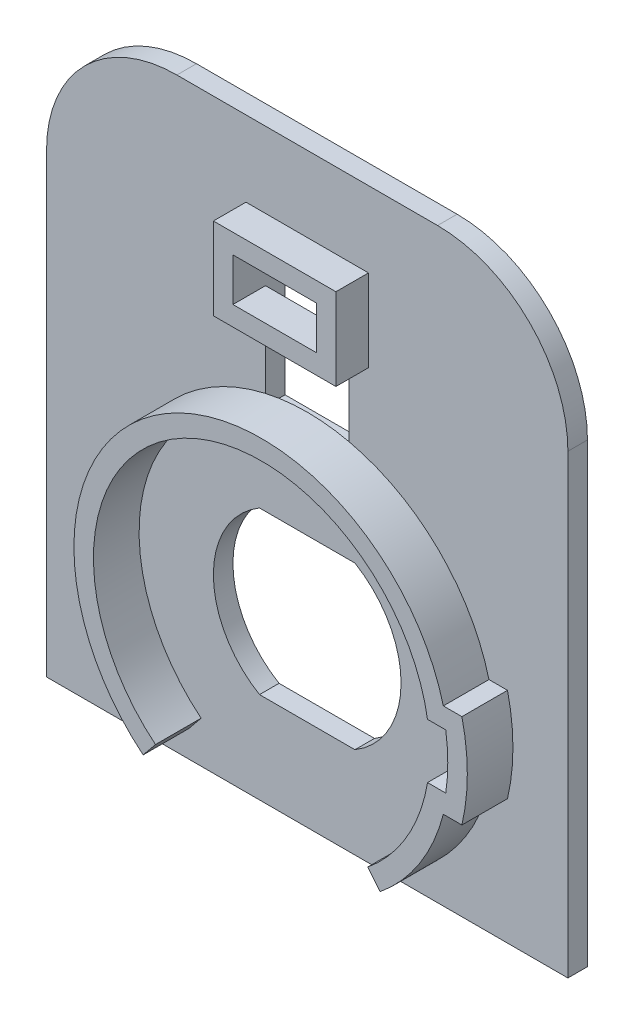
ISO-10303-21;
HEADER;
FILE_DESCRIPTION(('STEP AP214'),'2;1');
FILE_NAME('part.step','',(''),(''),'','','');
FILE_SCHEMA(('AUTOMOTIVE_DESIGN { 1 0 10303 214 1 1 1 1 }'));
ENDSEC;
DATA;
#1=APPLICATION_CONTEXT('core data for automotive mechanical design processes');
#2=APPLICATION_PROTOCOL_DEFINITION('international standard','automotive_design',2000,#1);
#3=PRODUCT_CONTEXT('',#1,'mechanical');
#4=PRODUCT('Part','Part','',(#3));
#5=PRODUCT_RELATED_PRODUCT_CATEGORY('part','',(#4));
#6=PRODUCT_DEFINITION_FORMATION('','',#4);
#7=PRODUCT_DEFINITION_CONTEXT('part definition',#1,'design');
#8=PRODUCT_DEFINITION('design','',#6,#7);
#9=PRODUCT_DEFINITION_SHAPE('','',#8);
#10=(LENGTH_UNIT() NAMED_UNIT(*) SI_UNIT(.MILLI.,.METRE.));
#11=(NAMED_UNIT(*) PLANE_ANGLE_UNIT() SI_UNIT($,.RADIAN.));
#12=(NAMED_UNIT(*) SI_UNIT($,.STERADIAN.) SOLID_ANGLE_UNIT());
#13=UNCERTAINTY_MEASURE_WITH_UNIT(LENGTH_MEASURE(1.E-05),#10,'distance_accuracy_value','');
#14=(GEOMETRIC_REPRESENTATION_CONTEXT(3) GLOBAL_UNCERTAINTY_ASSIGNED_CONTEXT((#13)) GLOBAL_UNIT_ASSIGNED_CONTEXT((#10,
#11,#12)) REPRESENTATION_CONTEXT('',''));
#15=CARTESIAN_POINT('',(0.,0.,0.));
#16=DIRECTION('',(0.,0.,1.));
#17=DIRECTION('',(1.,0.,0.));
#18=AXIS2_PLACEMENT_3D('',#15,#16,#17);
#19=CARTESIAN_POINT('',(0.,0.,1.5));
#20=DIRECTION('',(0.,0.,1.));
#21=DIRECTION('',(1.,0.,0.));
#22=AXIS2_PLACEMENT_3D('',#19,#20,#21);
#23=PLANE('',#22);
#24=CARTESIAN_POINT('',(0.,0.,1.5));
#25=DIRECTION('',(0.,0.,1.));
#26=DIRECTION('',(1.,0.,0.));
#27=AXIS2_PLACEMENT_3D('',#24,#25,#26);
#28=CIRCLE('',#27,7.2);
#29=CARTESIAN_POINT('',(3.66060104354463,-6.2,1.5));
#30=VERTEX_POINT('',#29);
#31=CARTESIAN_POINT('',(3.66060104354463,6.2,1.5));
#32=VERTEX_POINT('',#31);
#33=EDGE_CURVE('E345',#30,#32,#28,.T.);
#34=ORIENTED_EDGE('',*,*,#33,.F.);
#35=DIRECTION('',(1.,0.,0.));
#36=VECTOR('',#35,1.);
#37=CARTESIAN_POINT('',(0.,-6.2,1.5));
#38=LINE('',#37,#36);
#39=CARTESIAN_POINT('',(-3.66060104354463,-6.2,1.5));
#40=VERTEX_POINT('',#39);
#41=EDGE_CURVE('E348',#40,#30,#38,.T.);
#42=ORIENTED_EDGE('',*,*,#41,.F.);
#43=CARTESIAN_POINT('',(-3.66060104354463,6.2,1.5));
#44=VERTEX_POINT('',#43);
#45=EDGE_CURVE('E350',#44,#40,#28,.T.);
#46=ORIENTED_EDGE('',*,*,#45,.F.);
#47=DIRECTION('',(1.,0.,0.));
#48=VECTOR('',#47,1.);
#49=CARTESIAN_POINT('',(0.,6.2,1.5));
#50=LINE('',#49,#48);
#51=EDGE_CURVE('E353',#44,#32,#50,.T.);
#52=ORIENTED_EDGE('',*,*,#51,.T.);
#53=EDGE_LOOP('',(#34,#42,#46,#52));
#54=FACE_BOUND('',#53,.T.);
#55=DIRECTION('',(0.,-1.,0.));
#56=VECTOR('',#55,1.);
#57=CARTESIAN_POINT('',(20.,0.,1.5));
#58=LINE('',#57,#56);
#59=CARTESIAN_POINT('',(20.,21.8,1.5));
#60=VERTEX_POINT('',#59);
#61=CARTESIAN_POINT('',(20.,-13.2,1.5));
#62=VERTEX_POINT('',#61);
#63=EDGE_CURVE('E355',#60,#62,#58,.T.);
#64=ORIENTED_EDGE('',*,*,#63,.F.);
#65=CARTESIAN_POINT('',(10.,21.8,1.5));
#66=DIRECTION('',(0.,0.,1.));
#67=DIRECTION('',(1.,0.,0.));
#68=AXIS2_PLACEMENT_3D('',#65,#66,#67);
#69=CIRCLE('',#68,10.);
#70=CARTESIAN_POINT('',(10.,31.8,1.5));
#71=VERTEX_POINT('',#70);
#72=EDGE_CURVE('E424',#60,#71,#69,.T.);
#73=ORIENTED_EDGE('',*,*,#72,.T.);
#74=DIRECTION('',(1.,0.,0.));
#75=VECTOR('',#74,1.);
#76=CARTESIAN_POINT('',(0.,31.8,1.5));
#77=LINE('',#76,#75);
#78=CARTESIAN_POINT('',(-10.,31.8,1.5));
#79=VERTEX_POINT('',#78);
#80=EDGE_CURVE('E357',#79,#71,#77,.T.);
#81=ORIENTED_EDGE('',*,*,#80,.F.);
#82=CARTESIAN_POINT('',(-10.,21.8,1.5));
#83=DIRECTION('',(0.,0.,1.));
#84=DIRECTION('',(1.,0.,0.));
#85=AXIS2_PLACEMENT_3D('',#82,#83,#84);
#86=CIRCLE('',#85,10.);
#87=CARTESIAN_POINT('',(-20.,21.8,1.5));
#88=VERTEX_POINT('',#87);
#89=EDGE_CURVE('E82',#79,#88,#86,.T.);
#90=ORIENTED_EDGE('',*,*,#89,.T.);
#91=DIRECTION('',(0.,-1.,0.));
#92=VECTOR('',#91,1.);
#93=CARTESIAN_POINT('',(-20.,0.,1.5));
#94=LINE('',#93,#92);
#95=CARTESIAN_POINT('',(-20.,-13.2,1.5));
#96=VERTEX_POINT('',#95);
#97=EDGE_CURVE('E360',#88,#96,#94,.T.);
#98=ORIENTED_EDGE('',*,*,#97,.T.);
#99=DIRECTION('',(1.,0.,0.));
#100=VECTOR('',#99,1.);
#101=CARTESIAN_POINT('',(0.,-13.2,1.5));
#102=LINE('',#101,#100);
#103=EDGE_CURVE('E362',#96,#62,#102,.T.);
#104=ORIENTED_EDGE('',*,*,#103,.T.);
#105=EDGE_LOOP('',(#64,#73,#81,#90,#98,#104));
#106=FACE_BOUND('',#105,.T.);
#107=DIRECTION('',(0.631051149721789,0.775741223885136,0.));
#108=VECTOR('',#107,1.);
#109=CARTESIAN_POINT('',(0.,0.,1.5));
#110=LINE('',#109,#108);
#111=CARTESIAN_POINT('',(-9.08713655599376,-11.170673623946,1.5));
#112=VERTEX_POINT('',#111);
#113=CARTESIAN_POINT('',(-8.14055983141108,-10.0070617881182,1.5));
#114=VERTEX_POINT('',#113);
#115=EDGE_CURVE('E974',#112,#114,#110,.T.);
#116=ORIENTED_EDGE('',*,*,#115,.F.);
#117=CARTESIAN_POINT('',(0.,0.,1.5));
#118=DIRECTION('',(0.,0.,1.));
#119=DIRECTION('',(1.,0.,0.));
#120=AXIS2_PLACEMENT_3D('',#117,#118,#119);
#121=CIRCLE('',#120,14.4);
#122=CARTESIAN_POINT('',(-3.2,14.0399430198274,1.5));
#123=VERTEX_POINT('',#122);
#124=EDGE_CURVE('E979',#112,#123,#121,.F.);
#125=ORIENTED_EDGE('',*,*,#124,.T.);
#126=DIRECTION('',(0.,-1.,0.));
#127=VECTOR('',#126,1.);
#128=CARTESIAN_POINT('',(-3.2,0.,1.5));
#129=LINE('',#128,#127);
#130=CARTESIAN_POINT('',(-3.2,19.7,1.5));
#131=VERTEX_POINT('',#130);
#132=EDGE_CURVE('E366',#131,#123,#129,.T.);
#133=ORIENTED_EDGE('',*,*,#132,.F.);
#134=DIRECTION('',(-1.,0.,0.));
#135=VECTOR('',#134,1.);
#136=CARTESIAN_POINT('',(0.,19.7,1.5));
#137=LINE('',#136,#135);
#138=CARTESIAN_POINT('',(-4.7,19.7,1.5));
#139=VERTEX_POINT('',#138);
#140=EDGE_CURVE('E325',#131,#139,#137,.T.);
#141=ORIENTED_EDGE('',*,*,#140,.T.);
#142=DIRECTION('',(0.,1.,0.));
#143=VECTOR('',#142,1.);
#144=CARTESIAN_POINT('',(-4.70000000000001,0.,1.5));
#145=LINE('',#144,#143);
#146=CARTESIAN_POINT('',(-4.7,26.,1.5));
#147=VERTEX_POINT('',#146);
#148=EDGE_CURVE('E337',#139,#147,#145,.T.);
#149=ORIENTED_EDGE('',*,*,#148,.T.);
#150=DIRECTION('',(-1.,0.,0.));
#151=VECTOR('',#150,1.);
#152=CARTESIAN_POINT('',(0.,26.,1.5));
#153=LINE('',#152,#151);
#154=CARTESIAN_POINT('',(4.7,26.,1.5));
#155=VERTEX_POINT('',#154);
#156=EDGE_CURVE('E340',#155,#147,#153,.T.);
#157=ORIENTED_EDGE('',*,*,#156,.F.);
#158=DIRECTION('',(0.,1.,0.));
#159=VECTOR('',#158,1.);
#160=CARTESIAN_POINT('',(4.70000000000001,0.,1.5));
#161=LINE('',#160,#159);
#162=CARTESIAN_POINT('',(4.7,19.7,1.5));
#163=VERTEX_POINT('',#162);
#164=EDGE_CURVE('E342',#163,#155,#161,.T.);
#165=ORIENTED_EDGE('',*,*,#164,.F.);
#166=CARTESIAN_POINT('',(3.2,19.7,1.5));
#167=VERTEX_POINT('',#166);
#168=EDGE_CURVE('E336',#163,#167,#137,.T.);
#169=ORIENTED_EDGE('',*,*,#168,.T.);
#170=DIRECTION('',(0.,-1.,0.));
#171=VECTOR('',#170,1.);
#172=CARTESIAN_POINT('',(3.20000000000001,0.,1.5));
#173=LINE('',#172,#171);
#174=CARTESIAN_POINT('',(3.2,14.0399430198274,1.5));
#175=VERTEX_POINT('',#174);
#176=EDGE_CURVE('E290',#167,#175,#173,.T.);
#177=ORIENTED_EDGE('',*,*,#176,.T.);
#178=CARTESIAN_POINT('',(13.9427400463467,3.6,1.5));
#179=VERTEX_POINT('',#178);
#180=EDGE_CURVE('E976',#175,#179,#121,.F.);
#181=ORIENTED_EDGE('',*,*,#180,.T.);
#182=DIRECTION('',(1.,0.,0.));
#183=VECTOR('',#182,1.);
#184=CARTESIAN_POINT('',(0.,3.6,1.5));
#185=LINE('',#184,#183);
#186=CARTESIAN_POINT('',(15.3670950928388,3.6,1.5));
#187=VERTEX_POINT('',#186);
#188=EDGE_CURVE('E950',#179,#187,#185,.T.);
#189=ORIENTED_EDGE('',*,*,#188,.T.);
#190=CARTESIAN_POINT('',(0.,0.,1.5));
#191=DIRECTION('',(0.,0.,1.));
#192=DIRECTION('',(1.,0.,0.));
#193=AXIS2_PLACEMENT_3D('',#190,#191,#192);
#194=CIRCLE('',#193,15.7831432735166);
#195=CARTESIAN_POINT('',(15.3670950928388,-3.6,1.5));
#196=VERTEX_POINT('',#195);
#197=EDGE_CURVE('E953',#187,#196,#194,.F.);
#198=ORIENTED_EDGE('',*,*,#197,.T.);
#199=DIRECTION('',(-1.,0.,0.));
#200=VECTOR('',#199,1.);
#201=CARTESIAN_POINT('',(0.,-3.6,1.5));
#202=LINE('',#201,#200);
#203=CARTESIAN_POINT('',(13.9427400463467,-3.6,1.5));
#204=VERTEX_POINT('',#203);
#205=EDGE_CURVE('E956',#196,#204,#202,.T.);
#206=ORIENTED_EDGE('',*,*,#205,.T.);
#207=CARTESIAN_POINT('',(0.,0.,1.5));
#208=DIRECTION('',(0.,0.,1.));
#209=DIRECTION('',(1.,0.,0.));
#210=AXIS2_PLACEMENT_3D('',#207,#208,#209);
#211=CIRCLE('',#210,14.4);
#212=CARTESIAN_POINT('',(9.08713655599376,-11.170673623946,1.5));
#213=VERTEX_POINT('',#212);
#214=EDGE_CURVE('E959',#204,#213,#211,.F.);
#215=ORIENTED_EDGE('',*,*,#214,.T.);
#216=DIRECTION('',(0.631051149721789,-0.775741223885136,0.));
#217=VECTOR('',#216,1.);
#218=CARTESIAN_POINT('',(0.,0.,1.5));
#219=LINE('',#218,#217);
#220=CARTESIAN_POINT('',(8.14055983141107,-10.0070617881183,1.5));
#221=VERTEX_POINT('',#220);
#222=EDGE_CURVE('E962',#221,#213,#219,.T.);
#223=ORIENTED_EDGE('',*,*,#222,.F.);
#224=CARTESIAN_POINT('',(0.,0.,1.5));
#225=DIRECTION('',(0.,0.,1.));
#226=DIRECTION('',(1.,0.,0.));
#227=AXIS2_PLACEMENT_3D('',#224,#225,#226);
#228=CIRCLE('',#227,12.9);
#229=CARTESIAN_POINT('',(12.7279220613579,-2.1,1.5));
#230=VERTEX_POINT('',#229);
#231=EDGE_CURVE('E964',#230,#221,#228,.F.);
#232=ORIENTED_EDGE('',*,*,#231,.F.);
#233=DIRECTION('',(-1.,0.,0.));
#234=VECTOR('',#233,1.);
#235=CARTESIAN_POINT('',(0.,-2.1,1.5));
#236=LINE('',#235,#234);
#237=CARTESIAN_POINT('',(14.1279220613579,-2.1,1.5));
#238=VERTEX_POINT('',#237);
#239=EDGE_CURVE('E966',#238,#230,#236,.T.);
#240=ORIENTED_EDGE('',*,*,#239,.F.);
#241=CARTESIAN_POINT('',(0.,0.,1.5));
#242=DIRECTION('',(0.,0.,1.));
#243=DIRECTION('',(1.,0.,0.));
#244=AXIS2_PLACEMENT_3D('',#241,#242,#243);
#245=CIRCLE('',#244,14.2831432735166);
#246=CARTESIAN_POINT('',(14.1279220613579,2.1,1.5));
#247=VERTEX_POINT('',#246);
#248=EDGE_CURVE('E968',#247,#238,#245,.F.);
#249=ORIENTED_EDGE('',*,*,#248,.F.);
#250=DIRECTION('',(1.,0.,0.));
#251=VECTOR('',#250,1.);
#252=CARTESIAN_POINT('',(0.,2.1,1.5));
#253=LINE('',#252,#251);
#254=CARTESIAN_POINT('',(12.7279220613579,2.1,1.5));
#255=VERTEX_POINT('',#254);
#256=EDGE_CURVE('E970',#255,#247,#253,.T.);
#257=ORIENTED_EDGE('',*,*,#256,.F.);
#258=CARTESIAN_POINT('',(0.,0.,1.5));
#259=DIRECTION('',(0.,0.,1.));
#260=DIRECTION('',(1.,0.,0.));
#261=AXIS2_PLACEMENT_3D('',#258,#259,#260);
#262=CIRCLE('',#261,12.9);
#263=EDGE_CURVE('E972',#114,#255,#262,.F.);
#264=ORIENTED_EDGE('',*,*,#263,.F.);
#265=EDGE_LOOP('',(#116,#125,#133,#141,#149,#157,#165,#169,#177,#181,#189,#198,#206,#215,#223,
#232,#240,#249,#257,#264));
#266=FACE_BOUND('',#265,.T.);
#267=ADVANCED_FACE('F59',(#54,#106,#266),#23,.T.);
#268=CARTESIAN_POINT('',(3.20000000000001,0.,1.5));
#269=DIRECTION('',(1.,0.,0.));
#270=DIRECTION('',(0.,1.,0.));
#271=AXIS2_PLACEMENT_3D('',#268,#269,#270);
#272=PLANE('',#271);
#273=DIRECTION('',(0.,-1.,0.));
#274=VECTOR('',#273,1.);
#275=CARTESIAN_POINT('',(3.20000000000001,0.,0.));
#276=LINE('',#275,#274);
#277=CARTESIAN_POINT('',(3.2,24.5,0.));
#278=VERTEX_POINT('',#277);
#279=CARTESIAN_POINT('',(3.2,13.2,0.));
#280=VERTEX_POINT('',#279);
#281=EDGE_CURVE('E389',#278,#280,#276,.T.);
#282=ORIENTED_EDGE('',*,*,#281,.T.);
#283=DIRECTION('',(0.,0.,-1.));
#284=VECTOR('',#283,1.);
#285=CARTESIAN_POINT('',(3.2,13.2,1.5));
#286=LINE('',#285,#284);
#287=CARTESIAN_POINT('',(3.2,13.2,1.5));
#288=VERTEX_POINT('',#287);
#289=EDGE_CURVE('E872',#288,#280,#286,.T.);
#290=ORIENTED_EDGE('',*,*,#289,.F.);
#291=DIRECTION('',(0.,-1.,0.));
#292=VECTOR('',#291,1.);
#293=CARTESIAN_POINT('',(3.20000000000001,0.,1.5));
#294=LINE('',#293,#292);
#295=EDGE_CURVE('E293',#175,#288,#294,.T.);
#296=ORIENTED_EDGE('',*,*,#295,.F.);
#297=ORIENTED_EDGE('',*,*,#176,.F.);
#298=CARTESIAN_POINT('',(3.2,21.2,1.5));
#299=VERTEX_POINT('',#298);
#300=EDGE_CURVE('E282',#299,#167,#294,.T.);
#301=ORIENTED_EDGE('',*,*,#300,.F.);
#302=DIRECTION('',(0.,0.,-1.));
#303=VECTOR('',#302,1.);
#304=CARTESIAN_POINT('',(3.2,21.2,4.));
#305=LINE('',#304,#303);
#306=CARTESIAN_POINT('',(3.2,21.2,4.));
#307=VERTEX_POINT('',#306);
#308=EDGE_CURVE('E286',#307,#299,#305,.T.);
#309=ORIENTED_EDGE('',*,*,#308,.F.);
#310=DIRECTION('',(0.,-1.,0.));
#311=VECTOR('',#310,1.);
#312=CARTESIAN_POINT('',(3.20000000000001,0.,4.));
#313=LINE('',#312,#311);
#314=CARTESIAN_POINT('',(3.2,24.5,4.));
#315=VERTEX_POINT('',#314);
#316=EDGE_CURVE('E980',#315,#307,#313,.T.);
#317=ORIENTED_EDGE('',*,*,#316,.F.);
#318=DIRECTION('',(0.,0.,-1.));
#319=VECTOR('',#318,1.);
#320=CARTESIAN_POINT('',(3.2,24.5,1.5));
#321=LINE('',#320,#319);
#322=EDGE_CURVE('E394',#315,#278,#321,.T.);
#323=ORIENTED_EDGE('',*,*,#322,.T.);
#324=EDGE_LOOP('',(#282,#290,#296,#297,#301,#309,#317,#323));
#325=FACE_BOUND('',#324,.T.);
#326=ADVANCED_FACE('F283',(#325),#272,.F.);
#327=CARTESIAN_POINT('',(-3.2,0.,1.5));
#328=DIRECTION('',(1.,0.,0.));
#329=DIRECTION('',(0.,1.,0.));
#330=AXIS2_PLACEMENT_3D('',#327,#328,#329);
#331=PLANE('',#330);
#332=DIRECTION('',(0.,0.,-1.));
#333=VECTOR('',#332,1.);
#334=CARTESIAN_POINT('',(-3.2,21.2,4.));
#335=LINE('',#334,#333);
#336=CARTESIAN_POINT('',(-3.2,21.2,4.));
#337=VERTEX_POINT('',#336);
#338=CARTESIAN_POINT('',(-3.2,21.2,1.5));
#339=VERTEX_POINT('',#338);
#340=EDGE_CURVE('E303',#337,#339,#335,.T.);
#341=ORIENTED_EDGE('',*,*,#340,.T.);
#342=DIRECTION('',(0.,-1.,0.));
#343=VECTOR('',#342,1.);
#344=CARTESIAN_POINT('',(-3.2,0.,1.5));
#345=LINE('',#344,#343);
#346=EDGE_CURVE('E74',#339,#131,#345,.T.);
#347=ORIENTED_EDGE('',*,*,#346,.T.);
#348=ORIENTED_EDGE('',*,*,#132,.T.);
#349=CARTESIAN_POINT('',(-3.2,13.2,1.5));
#350=VERTEX_POINT('',#349);
#351=EDGE_CURVE('E298',#123,#350,#345,.T.);
#352=ORIENTED_EDGE('',*,*,#351,.T.);
#353=DIRECTION('',(0.,0.,-1.));
#354=VECTOR('',#353,1.);
#355=CARTESIAN_POINT('',(-3.2,13.2,1.5));
#356=LINE('',#355,#354);
#357=CARTESIAN_POINT('',(-3.2,13.2,0.));
#358=VERTEX_POINT('',#357);
#359=EDGE_CURVE('E869',#350,#358,#356,.T.);
#360=ORIENTED_EDGE('',*,*,#359,.T.);
#361=DIRECTION('',(0.,-1.,0.));
#362=VECTOR('',#361,1.);
#363=CARTESIAN_POINT('',(-3.2,0.,0.));
#364=LINE('',#363,#362);
#365=CARTESIAN_POINT('',(-3.2,24.5,0.));
#366=VERTEX_POINT('',#365);
#367=EDGE_CURVE('E391',#366,#358,#364,.T.);
#368=ORIENTED_EDGE('',*,*,#367,.F.);
#369=DIRECTION('',(0.,0.,-1.));
#370=VECTOR('',#369,1.);
#371=CARTESIAN_POINT('',(-3.2,24.5,1.5));
#372=LINE('',#371,#370);
#373=CARTESIAN_POINT('',(-3.2,24.5,4.));
#374=VERTEX_POINT('',#373);
#375=EDGE_CURVE('E397',#374,#366,#372,.T.);
#376=ORIENTED_EDGE('',*,*,#375,.F.);
#377=DIRECTION('',(0.,-1.,0.));
#378=VECTOR('',#377,1.);
#379=CARTESIAN_POINT('',(-3.20000000000001,0.,4.));
#380=LINE('',#379,#378);
#381=EDGE_CURVE('E309',#374,#337,#380,.T.);
#382=ORIENTED_EDGE('',*,*,#381,.T.);
#383=EDGE_LOOP('',(#341,#347,#348,#352,#360,#368,#376,#382));
#384=FACE_BOUND('',#383,.T.);
#385=ADVANCED_FACE('F454',(#384),#331,.T.);
#386=CARTESIAN_POINT('',(20.,0.,1.5));
#387=DIRECTION('',(1.,0.,0.));
#388=DIRECTION('',(0.,1.,0.));
#389=AXIS2_PLACEMENT_3D('',#386,#387,#388);
#390=PLANE('',#389);
#391=DIRECTION('',(0.,-1.,0.));
#392=VECTOR('',#391,1.);
#393=CARTESIAN_POINT('',(20.,0.,0.));
#394=LINE('',#393,#392);
#395=CARTESIAN_POINT('',(20.,21.8,0.));
#396=VERTEX_POINT('',#395);
#397=CARTESIAN_POINT('',(20.,-13.2,0.));
#398=VERTEX_POINT('',#397);
#399=EDGE_CURVE('E379',#396,#398,#394,.T.);
#400=ORIENTED_EDGE('',*,*,#399,.F.);
#401=DIRECTION('',(0.,0.,-1.));
#402=VECTOR('',#401,1.);
#403=CARTESIAN_POINT('',(20.,21.8,1.5));
#404=LINE('',#403,#402);
#405=EDGE_CURVE('E421',#396,#60,#404,.F.);
#406=ORIENTED_EDGE('',*,*,#405,.T.);
#407=ORIENTED_EDGE('',*,*,#63,.T.);
#408=DIRECTION('',(0.,0.,-1.));
#409=VECTOR('',#408,1.);
#410=CARTESIAN_POINT('',(20.,-13.2,1.5));
#411=LINE('',#410,#409);
#412=EDGE_CURVE('E401',#62,#398,#411,.T.);
#413=ORIENTED_EDGE('',*,*,#412,.T.);
#414=EDGE_LOOP('',(#400,#406,#407,#413));
#415=FACE_BOUND('',#414,.T.);
#416=ADVANCED_FACE('F452',(#415),#390,.T.);
#417=CARTESIAN_POINT('',(0.,31.8,1.5));
#418=DIRECTION('',(0.,1.,0.));
#419=DIRECTION('',(0.,0.,1.));
#420=AXIS2_PLACEMENT_3D('',#417,#418,#419);
#421=PLANE('',#420);
#422=ORIENTED_EDGE('',*,*,#80,.T.);
#423=DIRECTION('',(0.,0.,-1.));
#424=VECTOR('',#423,1.);
#425=CARTESIAN_POINT('',(10.,31.8,1.5));
#426=LINE('',#425,#424);
#427=CARTESIAN_POINT('',(10.,31.8,0.));
#428=VERTEX_POINT('',#427);
#429=EDGE_CURVE('E414',#71,#428,#426,.T.);
#430=ORIENTED_EDGE('',*,*,#429,.T.);
#431=DIRECTION('',(1.,0.,0.));
#432=VECTOR('',#431,1.);
#433=CARTESIAN_POINT('',(0.,31.8,0.));
#434=LINE('',#433,#432);
#435=CARTESIAN_POINT('',(-10.,31.8,0.));
#436=VERTEX_POINT('',#435);
#437=EDGE_CURVE('E381',#436,#428,#434,.T.);
#438=ORIENTED_EDGE('',*,*,#437,.F.);
#439=DIRECTION('',(0.,0.,-1.));
#440=VECTOR('',#439,1.);
#441=CARTESIAN_POINT('',(-10.,31.8,1.5));
#442=LINE('',#441,#440);
#443=EDGE_CURVE('E400',#436,#79,#442,.F.);
#444=ORIENTED_EDGE('',*,*,#443,.T.);
#445=EDGE_LOOP('',(#422,#430,#438,#444));
#446=FACE_BOUND('',#445,.T.);
#447=ADVANCED_FACE('F450',(#446),#421,.T.);
#448=CARTESIAN_POINT('',(-20.,0.,1.5));
#449=DIRECTION('',(1.,0.,0.));
#450=DIRECTION('',(0.,1.,0.));
#451=AXIS2_PLACEMENT_3D('',#448,#449,#450);
#452=PLANE('',#451);
#453=ORIENTED_EDGE('',*,*,#97,.F.);
#454=DIRECTION('',(0.,0.,-1.));
#455=VECTOR('',#454,1.);
#456=CARTESIAN_POINT('',(-20.,21.8,0.));
#457=LINE('',#456,#455);
#458=CARTESIAN_POINT('',(-20.,21.8,0.));
#459=VERTEX_POINT('',#458);
#460=EDGE_CURVE('E67',#88,#459,#457,.T.);
#461=ORIENTED_EDGE('',*,*,#460,.T.);
#462=DIRECTION('',(0.,-1.,0.));
#463=VECTOR('',#462,1.);
#464=CARTESIAN_POINT('',(-20.,0.,0.));
#465=LINE('',#464,#463);
#466=CARTESIAN_POINT('',(-20.,-13.2,0.));
#467=VERTEX_POINT('',#466);
#468=EDGE_CURVE('E384',#459,#467,#465,.T.);
#469=ORIENTED_EDGE('',*,*,#468,.T.);
#470=DIRECTION('',(0.,0.,-1.));
#471=VECTOR('',#470,1.);
#472=CARTESIAN_POINT('',(-20.,-13.2,1.5));
#473=LINE('',#472,#471);
#474=EDGE_CURVE('E398',#96,#467,#473,.T.);
#475=ORIENTED_EDGE('',*,*,#474,.F.);
#476=EDGE_LOOP('',(#453,#461,#469,#475));
#477=FACE_BOUND('',#476,.T.);
#478=ADVANCED_FACE('F429',(#477),#452,.F.);
#479=CARTESIAN_POINT('',(0.,0.,1.5));
#480=DIRECTION('',(0.,0.,-1.));
#481=DIRECTION('',(-1.,0.,0.));
#482=AXIS2_PLACEMENT_3D('',#479,#480,#481);
#483=CYLINDRICAL_SURFACE('',#482,7.2);
#484=CARTESIAN_POINT('',(0.,0.,0.));
#485=DIRECTION('',(0.,0.,1.));
#486=DIRECTION('',(1.,0.,0.));
#487=AXIS2_PLACEMENT_3D('',#484,#485,#486);
#488=CIRCLE('',#487,7.2);
#489=CARTESIAN_POINT('',(3.66060104354463,-6.2,0.));
#490=VERTEX_POINT('',#489);
#491=CARTESIAN_POINT('',(3.66060104354463,6.2,0.));
#492=VERTEX_POINT('',#491);
#493=EDGE_CURVE('E344',#490,#492,#488,.T.);
#494=ORIENTED_EDGE('',*,*,#493,.F.);
#495=DIRECTION('',(0.,0.,-1.));
#496=VECTOR('',#495,1.);
#497=CARTESIAN_POINT('',(3.66060104354463,-6.2,1.5));
#498=LINE('',#497,#496);
#499=EDGE_CURVE('E404',#30,#490,#498,.T.);
#500=ORIENTED_EDGE('',*,*,#499,.F.);
#501=ORIENTED_EDGE('',*,*,#33,.T.);
#502=DIRECTION('',(0.,0.,-1.));
#503=VECTOR('',#502,1.);
#504=CARTESIAN_POINT('',(3.66060104354463,6.2,1.5));
#505=LINE('',#504,#503);
#506=EDGE_CURVE('E369',#32,#492,#505,.T.);
#507=ORIENTED_EDGE('',*,*,#506,.T.);
#508=EDGE_LOOP('',(#494,#500,#501,#507));
#509=FACE_BOUND('',#508,.T.);
#510=ADVANCED_FACE('F488',(#509),#483,.F.);
#511=CARTESIAN_POINT('',(0.,-6.2,1.5));
#512=DIRECTION('',(0.,1.,0.));
#513=DIRECTION('',(0.,0.,1.));
#514=AXIS2_PLACEMENT_3D('',#511,#512,#513);
#515=PLANE('',#514);
#516=DIRECTION('',(1.,0.,0.));
#517=VECTOR('',#516,1.);
#518=CARTESIAN_POINT('',(0.,-6.2,0.));
#519=LINE('',#518,#517);
#520=CARTESIAN_POINT('',(-3.66060104354463,-6.2,0.));
#521=VERTEX_POINT('',#520);
#522=EDGE_CURVE('E372',#521,#490,#519,.T.);
#523=ORIENTED_EDGE('',*,*,#522,.F.);
#524=DIRECTION('',(0.,0.,-1.));
#525=VECTOR('',#524,1.);
#526=CARTESIAN_POINT('',(-3.66060104354463,-6.2,1.5));
#527=LINE('',#526,#525);
#528=EDGE_CURVE('E410',#40,#521,#527,.T.);
#529=ORIENTED_EDGE('',*,*,#528,.F.);
#530=ORIENTED_EDGE('',*,*,#41,.T.);
#531=ORIENTED_EDGE('',*,*,#499,.T.);
#532=EDGE_LOOP('',(#523,#529,#530,#531));
#533=FACE_BOUND('',#532,.T.);
#534=ADVANCED_FACE('F492',(#533),#515,.T.);
#535=CARTESIAN_POINT('',(-3.66060104354463,6.2,0.));
#536=VERTEX_POINT('',#535);
#537=EDGE_CURVE('E373',#536,#521,#488,.T.);
#538=ORIENTED_EDGE('',*,*,#537,.F.);
#539=DIRECTION('',(0.,0.,-1.));
#540=VECTOR('',#539,1.);
#541=CARTESIAN_POINT('',(-3.66060104354463,6.2,1.5));
#542=LINE('',#541,#540);
#543=EDGE_CURVE('E408',#44,#536,#542,.T.);
#544=ORIENTED_EDGE('',*,*,#543,.F.);
#545=ORIENTED_EDGE('',*,*,#45,.T.);
#546=ORIENTED_EDGE('',*,*,#528,.T.);
#547=EDGE_LOOP('',(#538,#544,#545,#546));
#548=FACE_BOUND('',#547,.T.);
#549=ADVANCED_FACE('F486',(#548),#483,.F.);
#550=CARTESIAN_POINT('',(0.,-13.2,1.5));
#551=DIRECTION('',(0.,1.,0.));
#552=DIRECTION('',(0.,0.,1.));
#553=AXIS2_PLACEMENT_3D('',#550,#551,#552);
#554=PLANE('',#553);
#555=DIRECTION('',(1.,0.,0.));
#556=VECTOR('',#555,1.);
#557=CARTESIAN_POINT('',(0.,-13.2,0.));
#558=LINE('',#557,#556);
#559=EDGE_CURVE('E386',#467,#398,#558,.T.);
#560=ORIENTED_EDGE('',*,*,#559,.T.);
#561=ORIENTED_EDGE('',*,*,#412,.F.);
#562=ORIENTED_EDGE('',*,*,#103,.F.);
#563=ORIENTED_EDGE('',*,*,#474,.T.);
#564=EDGE_LOOP('',(#560,#561,#562,#563));
#565=FACE_BOUND('',#564,.T.);
#566=ADVANCED_FACE('F440',(#565),#554,.F.);
#567=CARTESIAN_POINT('',(0.,6.2,1.5));
#568=DIRECTION('',(0.,1.,0.));
#569=DIRECTION('',(0.,0.,1.));
#570=AXIS2_PLACEMENT_3D('',#567,#568,#569);
#571=PLANE('',#570);
#572=DIRECTION('',(1.,0.,0.));
#573=VECTOR('',#572,1.);
#574=CARTESIAN_POINT('',(0.,6.2,0.));
#575=LINE('',#574,#573);
#576=EDGE_CURVE('E376',#536,#492,#575,.T.);
#577=ORIENTED_EDGE('',*,*,#576,.T.);
#578=ORIENTED_EDGE('',*,*,#506,.F.);
#579=ORIENTED_EDGE('',*,*,#51,.F.);
#580=ORIENTED_EDGE('',*,*,#543,.T.);
#581=EDGE_LOOP('',(#577,#578,#579,#580));
#582=FACE_BOUND('',#581,.T.);
#583=ADVANCED_FACE('F481',(#582),#571,.F.);
#584=CARTESIAN_POINT('',(0.,24.5,1.5));
#585=DIRECTION('',(0.,1.,0.));
#586=DIRECTION('',(0.,0.,1.));
#587=AXIS2_PLACEMENT_3D('',#584,#585,#586);
#588=PLANE('',#587);
#589=DIRECTION('',(1.,0.,0.));
#590=VECTOR('',#589,1.);
#591=CARTESIAN_POINT('',(0.,24.5,0.));
#592=LINE('',#591,#590);
#593=EDGE_CURVE('E349',#366,#278,#592,.T.);
#594=ORIENTED_EDGE('',*,*,#593,.T.);
#595=ORIENTED_EDGE('',*,*,#322,.F.);
#596=DIRECTION('',(1.,0.,0.));
#597=VECTOR('',#596,1.);
#598=CARTESIAN_POINT('',(0.,24.5,4.));
#599=LINE('',#598,#597);
#600=EDGE_CURVE('E304',#374,#315,#599,.T.);
#601=ORIENTED_EDGE('',*,*,#600,.F.);
#602=ORIENTED_EDGE('',*,*,#375,.T.);
#603=EDGE_LOOP('',(#594,#595,#601,#602));
#604=FACE_BOUND('',#603,.T.);
#605=ADVANCED_FACE('F478',(#604),#588,.F.);
#606=CARTESIAN_POINT('',(0.,0.,0.));
#607=DIRECTION('',(0.,0.,1.));
#608=DIRECTION('',(1.,0.,0.));
#609=AXIS2_PLACEMENT_3D('',#606,#607,#608);
#610=PLANE('',#609);
#611=DIRECTION('',(1.,0.,0.));
#612=VECTOR('',#611,1.);
#613=CARTESIAN_POINT('',(0.,13.2,0.));
#614=LINE('',#613,#612);
#615=EDGE_CURVE('E866',#358,#280,#614,.T.);
#616=ORIENTED_EDGE('',*,*,#615,.T.);
#617=ORIENTED_EDGE('',*,*,#281,.F.);
#618=ORIENTED_EDGE('',*,*,#593,.F.);
#619=ORIENTED_EDGE('',*,*,#367,.T.);
#620=EDGE_LOOP('',(#616,#617,#618,#619));
#621=FACE_BOUND('',#620,.T.);
#622=ORIENTED_EDGE('',*,*,#493,.T.);
#623=ORIENTED_EDGE('',*,*,#576,.F.);
#624=ORIENTED_EDGE('',*,*,#537,.T.);
#625=ORIENTED_EDGE('',*,*,#522,.T.);
#626=EDGE_LOOP('',(#622,#623,#624,#625));
#627=FACE_BOUND('',#626,.T.);
#628=ORIENTED_EDGE('',*,*,#437,.T.);
#629=CARTESIAN_POINT('',(10.,21.8,0.));
#630=DIRECTION('',(0.,0.,1.));
#631=DIRECTION('',(1.,0.,0.));
#632=AXIS2_PLACEMENT_3D('',#629,#630,#631);
#633=CIRCLE('',#632,10.);
#634=EDGE_CURVE('E419',#428,#396,#633,.F.);
#635=ORIENTED_EDGE('',*,*,#634,.T.);
#636=ORIENTED_EDGE('',*,*,#399,.T.);
#637=ORIENTED_EDGE('',*,*,#559,.F.);
#638=ORIENTED_EDGE('',*,*,#468,.F.);
#639=CARTESIAN_POINT('',(-10.,21.8,0.));
#640=DIRECTION('',(0.,0.,1.));
#641=DIRECTION('',(1.,0.,0.));
#642=AXIS2_PLACEMENT_3D('',#639,#640,#641);
#643=CIRCLE('',#642,10.);
#644=EDGE_CURVE('E417',#459,#436,#643,.F.);
#645=ORIENTED_EDGE('',*,*,#644,.T.);
#646=EDGE_LOOP('',(#628,#635,#636,#637,#638,#645));
#647=FACE_BOUND('',#646,.T.);
#648=ADVANCED_FACE('F434',(#621,#627,#647),#610,.F.);
#649=CARTESIAN_POINT('',(10.,21.8,1.5));
#650=DIRECTION('',(0.,0.,-1.));
#651=DIRECTION('',(-1.,0.,0.));
#652=AXIS2_PLACEMENT_3D('',#649,#650,#651);
#653=CYLINDRICAL_SURFACE('',#652,10.);
#654=ORIENTED_EDGE('',*,*,#72,.F.);
#655=ORIENTED_EDGE('',*,*,#405,.F.);
#656=ORIENTED_EDGE('',*,*,#634,.F.);
#657=ORIENTED_EDGE('',*,*,#429,.F.);
#658=EDGE_LOOP('',(#654,#655,#656,#657));
#659=FACE_BOUND('',#658,.T.);
#660=ADVANCED_FACE('F448',(#659),#653,.T.);
#661=CARTESIAN_POINT('',(-10.,21.8,1.5));
#662=DIRECTION('',(0.,0.,1.));
#663=DIRECTION('',(1.,0.,0.));
#664=AXIS2_PLACEMENT_3D('',#661,#662,#663);
#665=CYLINDRICAL_SURFACE('',#664,10.);
#666=ORIENTED_EDGE('',*,*,#89,.F.);
#667=ORIENTED_EDGE('',*,*,#443,.F.);
#668=ORIENTED_EDGE('',*,*,#644,.F.);
#669=ORIENTED_EDGE('',*,*,#460,.F.);
#670=EDGE_LOOP('',(#666,#667,#668,#669));
#671=FACE_BOUND('',#670,.T.);
#672=ADVANCED_FACE('F61',(#671),#665,.T.);
#673=CARTESIAN_POINT('',(0.,19.7,4.));
#674=DIRECTION('',(0.,1.,0.));
#675=DIRECTION('',(0.,0.,1.));
#676=AXIS2_PLACEMENT_3D('',#673,#674,#675);
#677=PLANE('',#676);
#678=ORIENTED_EDGE('',*,*,#140,.F.);
#679=DIRECTION('',(1.,0.,0.));
#680=VECTOR('',#679,1.);
#681=CARTESIAN_POINT('',(0.,19.7,1.5));
#682=LINE('',#681,#680);
#683=EDGE_CURVE('E881',#131,#167,#682,.T.);
#684=ORIENTED_EDGE('',*,*,#683,.T.);
#685=ORIENTED_EDGE('',*,*,#168,.F.);
#686=DIRECTION('',(0.,0.,-1.));
#687=VECTOR('',#686,1.);
#688=CARTESIAN_POINT('',(4.7,19.7,4.));
#689=LINE('',#688,#687);
#690=CARTESIAN_POINT('',(4.7,19.7,4.));
#691=VERTEX_POINT('',#690);
#692=EDGE_CURVE('E321',#691,#163,#689,.T.);
#693=ORIENTED_EDGE('',*,*,#692,.F.);
#694=DIRECTION('',(1.,0.,0.));
#695=VECTOR('',#694,1.);
#696=CARTESIAN_POINT('',(0.,19.7,4.));
#697=LINE('',#696,#695);
#698=CARTESIAN_POINT('',(-4.7,19.7,4.));
#699=VERTEX_POINT('',#698);
#700=EDGE_CURVE('E314',#699,#691,#697,.T.);
#701=ORIENTED_EDGE('',*,*,#700,.F.);
#702=DIRECTION('',(0.,0.,-1.));
#703=VECTOR('',#702,1.);
#704=CARTESIAN_POINT('',(-4.7,19.7,4.));
#705=LINE('',#704,#703);
#706=EDGE_CURVE('E329',#699,#139,#705,.T.);
#707=ORIENTED_EDGE('',*,*,#706,.T.);
#708=EDGE_LOOP('',(#678,#684,#685,#693,#701,#707));
#709=FACE_BOUND('',#708,.T.);
#710=ADVANCED_FACE('F543',(#709),#677,.F.);
#711=CARTESIAN_POINT('',(4.70000000000001,0.,4.));
#712=DIRECTION('',(1.,0.,0.));
#713=DIRECTION('',(0.,1.,0.));
#714=AXIS2_PLACEMENT_3D('',#711,#712,#713);
#715=PLANE('',#714);
#716=ORIENTED_EDGE('',*,*,#692,.T.);
#717=ORIENTED_EDGE('',*,*,#164,.T.);
#718=DIRECTION('',(0.,0.,-1.));
#719=VECTOR('',#718,1.);
#720=CARTESIAN_POINT('',(4.7,26.,4.));
#721=LINE('',#720,#719);
#722=CARTESIAN_POINT('',(4.7,26.,4.));
#723=VERTEX_POINT('',#722);
#724=EDGE_CURVE('E322',#723,#155,#721,.T.);
#725=ORIENTED_EDGE('',*,*,#724,.F.);
#726=DIRECTION('',(0.,-1.,0.));
#727=VECTOR('',#726,1.);
#728=CARTESIAN_POINT('',(4.70000000000001,0.,4.));
#729=LINE('',#728,#727);
#730=EDGE_CURVE('E306',#723,#691,#729,.T.);
#731=ORIENTED_EDGE('',*,*,#730,.T.);
#732=EDGE_LOOP('',(#716,#717,#725,#731));
#733=FACE_BOUND('',#732,.T.);
#734=ADVANCED_FACE('F474',(#733),#715,.T.);
#735=CARTESIAN_POINT('',(0.,26.,4.));
#736=DIRECTION('',(0.,1.,0.));
#737=DIRECTION('',(0.,0.,1.));
#738=AXIS2_PLACEMENT_3D('',#735,#736,#737);
#739=PLANE('',#738);
#740=ORIENTED_EDGE('',*,*,#724,.T.);
#741=ORIENTED_EDGE('',*,*,#156,.T.);
#742=DIRECTION('',(0.,0.,-1.));
#743=VECTOR('',#742,1.);
#744=CARTESIAN_POINT('',(-4.7,26.,4.));
#745=LINE('',#744,#743);
#746=CARTESIAN_POINT('',(-4.7,26.,4.));
#747=VERTEX_POINT('',#746);
#748=EDGE_CURVE('E326',#747,#147,#745,.T.);
#749=ORIENTED_EDGE('',*,*,#748,.F.);
#750=DIRECTION('',(1.,0.,0.));
#751=VECTOR('',#750,1.);
#752=CARTESIAN_POINT('',(0.,26.,4.));
#753=LINE('',#752,#751);
#754=EDGE_CURVE('E318',#747,#723,#753,.T.);
#755=ORIENTED_EDGE('',*,*,#754,.T.);
#756=EDGE_LOOP('',(#740,#741,#749,#755));
#757=FACE_BOUND('',#756,.T.);
#758=ADVANCED_FACE('F554',(#757),#739,.T.);
#759=CARTESIAN_POINT('',(-4.70000000000001,0.,4.));
#760=DIRECTION('',(1.,0.,0.));
#761=DIRECTION('',(0.,1.,0.));
#762=AXIS2_PLACEMENT_3D('',#759,#760,#761);
#763=PLANE('',#762);
#764=ORIENTED_EDGE('',*,*,#148,.F.);
#765=ORIENTED_EDGE('',*,*,#706,.F.);
#766=DIRECTION('',(0.,-1.,0.));
#767=VECTOR('',#766,1.);
#768=CARTESIAN_POINT('',(-4.70000000000001,0.,4.));
#769=LINE('',#768,#767);
#770=EDGE_CURVE('E316',#747,#699,#769,.T.);
#771=ORIENTED_EDGE('',*,*,#770,.F.);
#772=ORIENTED_EDGE('',*,*,#748,.T.);
#773=EDGE_LOOP('',(#764,#765,#771,#772));
#774=FACE_BOUND('',#773,.T.);
#775=ADVANCED_FACE('F561',(#774),#763,.F.);
#776=CARTESIAN_POINT('',(0.,0.,4.));
#777=DIRECTION('',(0.,0.,1.));
#778=DIRECTION('',(1.,0.,0.));
#779=AXIS2_PLACEMENT_3D('',#776,#777,#778);
#780=PLANE('',#779);
#781=ORIENTED_EDGE('',*,*,#316,.T.);
#782=DIRECTION('',(1.,0.,0.));
#783=VECTOR('',#782,1.);
#784=CARTESIAN_POINT('',(0.,21.2,4.));
#785=LINE('',#784,#783);
#786=EDGE_CURVE('E302',#337,#307,#785,.T.);
#787=ORIENTED_EDGE('',*,*,#786,.F.);
#788=ORIENTED_EDGE('',*,*,#381,.F.);
#789=ORIENTED_EDGE('',*,*,#600,.T.);
#790=EDGE_LOOP('',(#781,#787,#788,#789));
#791=FACE_BOUND('',#790,.T.);
#792=ORIENTED_EDGE('',*,*,#730,.F.);
#793=ORIENTED_EDGE('',*,*,#754,.F.);
#794=ORIENTED_EDGE('',*,*,#770,.T.);
#795=ORIENTED_EDGE('',*,*,#700,.T.);
#796=EDGE_LOOP('',(#792,#793,#794,#795));
#797=FACE_BOUND('',#796,.T.);
#798=ADVANCED_FACE('F569',(#791,#797),#780,.T.);
#799=CARTESIAN_POINT('',(0.,21.2,4.));
#800=DIRECTION('',(0.,1.,0.));
#801=DIRECTION('',(0.,0.,1.));
#802=AXIS2_PLACEMENT_3D('',#799,#800,#801);
#803=PLANE('',#802);
#804=DIRECTION('',(1.,0.,0.));
#805=VECTOR('',#804,1.);
#806=CARTESIAN_POINT('',(0.,21.2,1.5));
#807=LINE('',#806,#805);
#808=EDGE_CURVE('E292',#339,#299,#807,.T.);
#809=ORIENTED_EDGE('',*,*,#808,.F.);
#810=ORIENTED_EDGE('',*,*,#340,.F.);
#811=ORIENTED_EDGE('',*,*,#786,.T.);
#812=ORIENTED_EDGE('',*,*,#308,.T.);
#813=EDGE_LOOP('',(#809,#810,#811,#812));
#814=FACE_BOUND('',#813,.T.);
#815=ADVANCED_FACE('F300',(#814),#803,.T.);
#816=CARTESIAN_POINT('',(0.,0.,5.));
#817=DIRECTION('',(0.,0.,-1.));
#818=DIRECTION('',(-1.,0.,0.));
#819=AXIS2_PLACEMENT_3D('',#816,#817,#818);
#820=CYLINDRICAL_SURFACE('',#819,14.4);
#821=ORIENTED_EDGE('',*,*,#180,.F.);
#822=CARTESIAN_POINT('',(0.,0.,1.5));
#823=DIRECTION('',(0.,0.,1.));
#824=DIRECTION('',(1.,0.,0.));
#825=AXIS2_PLACEMENT_3D('',#822,#823,#824);
#826=CIRCLE('',#825,14.4);
#827=EDGE_CURVE('E12',#175,#123,#826,.T.);
#828=ORIENTED_EDGE('',*,*,#827,.T.);
#829=ORIENTED_EDGE('',*,*,#124,.F.);
#830=DIRECTION('',(0.,0.,-1.));
#831=VECTOR('',#830,1.);
#832=CARTESIAN_POINT('',(-9.08713655599376,-11.170673623946,5.));
#833=LINE('',#832,#831);
#834=CARTESIAN_POINT('',(-9.08713655599376,-11.170673623946,5.));
#835=VERTEX_POINT('',#834);
#836=EDGE_CURVE('E947',#835,#112,#833,.T.);
#837=ORIENTED_EDGE('',*,*,#836,.F.);
#838=CARTESIAN_POINT('',(0.,0.,5.));
#839=DIRECTION('',(0.,0.,1.));
#840=DIRECTION('',(1.,0.,0.));
#841=AXIS2_PLACEMENT_3D('',#838,#839,#840);
#842=CIRCLE('',#841,14.4);
#843=CARTESIAN_POINT('',(13.9427400463467,3.6,5.));
#844=VERTEX_POINT('',#843);
#845=EDGE_CURVE('E883',#844,#835,#842,.T.);
#846=ORIENTED_EDGE('',*,*,#845,.F.);
#847=DIRECTION('',(0.,0.,-1.));
#848=VECTOR('',#847,1.);
#849=CARTESIAN_POINT('',(13.9427400463467,3.6,5.));
#850=LINE('',#849,#848);
#851=EDGE_CURVE('E914',#844,#179,#850,.T.);
#852=ORIENTED_EDGE('',*,*,#851,.T.);
#853=EDGE_LOOP('',(#821,#828,#829,#837,#846,#852));
#854=FACE_BOUND('',#853,.T.);
#855=ADVANCED_FACE('F584',(#854),#820,.T.);
#856=CARTESIAN_POINT('',(-8.14055983141108,-10.0070617881182,5.));
#857=DIRECTION('',(0.775741223885136,-0.631051149721789,0.));
#858=DIRECTION('',(0.631051149721789,0.775741223885136,0.));
#859=AXIS2_PLACEMENT_3D('',#856,#857,#858);
#860=PLANE('',#859);
#861=ORIENTED_EDGE('',*,*,#836,.T.);
#862=ORIENTED_EDGE('',*,*,#115,.T.);
#863=DIRECTION('',(0.,0.,-1.));
#864=VECTOR('',#863,1.);
#865=CARTESIAN_POINT('',(-8.14055983141108,-10.0070617881182,5.));
#866=LINE('',#865,#864);
#867=CARTESIAN_POINT('',(-8.14055983141108,-10.0070617881182,5.));
#868=VERTEX_POINT('',#867);
#869=EDGE_CURVE('E944',#868,#114,#866,.T.);
#870=ORIENTED_EDGE('',*,*,#869,.F.);
#871=DIRECTION('',(-0.631051149721789,-0.775741223885136,0.));
#872=VECTOR('',#871,1.);
#873=CARTESIAN_POINT('',(-8.14055983141108,-10.0070617881182,5.));
#874=LINE('',#873,#872);
#875=EDGE_CURVE('E885',#868,#835,#874,.T.);
#876=ORIENTED_EDGE('',*,*,#875,.T.);
#877=EDGE_LOOP('',(#861,#862,#870,#876));
#878=FACE_BOUND('',#877,.T.);
#879=ADVANCED_FACE('F591',(#878),#860,.T.);
#880=CARTESIAN_POINT('',(0.,0.,5.));
#881=DIRECTION('',(0.,0.,-1.));
#882=DIRECTION('',(-1.,0.,0.));
#883=AXIS2_PLACEMENT_3D('',#880,#881,#882);
#884=CYLINDRICAL_SURFACE('',#883,12.9);
#885=ORIENTED_EDGE('',*,*,#869,.T.);
#886=ORIENTED_EDGE('',*,*,#263,.T.);
#887=DIRECTION('',(0.,0.,-1.));
#888=VECTOR('',#887,1.);
#889=CARTESIAN_POINT('',(12.7279220613579,2.1,5.));
#890=LINE('',#889,#888);
#891=CARTESIAN_POINT('',(12.7279220613579,2.1,5.));
#892=VERTEX_POINT('',#891);
#893=EDGE_CURVE('E941',#892,#255,#890,.T.);
#894=ORIENTED_EDGE('',*,*,#893,.F.);
#895=CARTESIAN_POINT('',(0.,0.,5.));
#896=DIRECTION('',(0.,0.,1.));
#897=DIRECTION('',(1.,0.,0.));
#898=AXIS2_PLACEMENT_3D('',#895,#896,#897);
#899=CIRCLE('',#898,12.9);
#900=EDGE_CURVE('E888',#892,#868,#899,.T.);
#901=ORIENTED_EDGE('',*,*,#900,.T.);
#902=EDGE_LOOP('',(#885,#886,#894,#901));
#903=FACE_BOUND('',#902,.T.);
#904=ADVANCED_FACE('F599',(#903),#884,.F.);
#905=CARTESIAN_POINT('',(12.7279220613579,2.1,5.));
#906=DIRECTION('',(0.,-1.,0.));
#907=DIRECTION('',(0.,0.,-1.));
#908=AXIS2_PLACEMENT_3D('',#905,#906,#907);
#909=PLANE('',#908);
#910=ORIENTED_EDGE('',*,*,#893,.T.);
#911=ORIENTED_EDGE('',*,*,#256,.T.);
#912=DIRECTION('',(0.,0.,-1.));
#913=VECTOR('',#912,1.);
#914=CARTESIAN_POINT('',(14.1279220613579,2.1,5.));
#915=LINE('',#914,#913);
#916=CARTESIAN_POINT('',(14.1279220613579,2.1,5.));
#917=VERTEX_POINT('',#916);
#918=EDGE_CURVE('E938',#917,#247,#915,.T.);
#919=ORIENTED_EDGE('',*,*,#918,.F.);
#920=DIRECTION('',(-1.,0.,0.));
#921=VECTOR('',#920,1.);
#922=CARTESIAN_POINT('',(12.7279220613579,2.1,5.));
#923=LINE('',#922,#921);
#924=EDGE_CURVE('E891',#917,#892,#923,.T.);
#925=ORIENTED_EDGE('',*,*,#924,.T.);
#926=EDGE_LOOP('',(#910,#911,#919,#925));
#927=FACE_BOUND('',#926,.T.);
#928=ADVANCED_FACE('F607',(#927),#909,.T.);
#929=CARTESIAN_POINT('',(0.,0.,5.));
#930=DIRECTION('',(0.,0.,-1.));
#931=DIRECTION('',(-1.,0.,0.));
#932=AXIS2_PLACEMENT_3D('',#929,#930,#931);
#933=CYLINDRICAL_SURFACE('',#932,14.2831432735166);
#934=ORIENTED_EDGE('',*,*,#918,.T.);
#935=ORIENTED_EDGE('',*,*,#248,.T.);
#936=DIRECTION('',(0.,0.,-1.));
#937=VECTOR('',#936,1.);
#938=CARTESIAN_POINT('',(14.1279220613579,-2.1,5.));
#939=LINE('',#938,#937);
#940=CARTESIAN_POINT('',(14.1279220613579,-2.1,5.));
#941=VERTEX_POINT('',#940);
#942=EDGE_CURVE('E935',#941,#238,#939,.T.);
#943=ORIENTED_EDGE('',*,*,#942,.F.);
#944=CARTESIAN_POINT('',(0.,0.,5.));
#945=DIRECTION('',(0.,0.,1.));
#946=DIRECTION('',(1.,0.,0.));
#947=AXIS2_PLACEMENT_3D('',#944,#945,#946);
#948=CIRCLE('',#947,14.2831432735166);
#949=EDGE_CURVE('E894',#941,#917,#948,.T.);
#950=ORIENTED_EDGE('',*,*,#949,.T.);
#951=EDGE_LOOP('',(#934,#935,#943,#950));
#952=FACE_BOUND('',#951,.T.);
#953=ADVANCED_FACE('F615',(#952),#933,.F.);
#954=CARTESIAN_POINT('',(12.7279220613579,-2.1,5.));
#955=DIRECTION('',(0.,1.,0.));
#956=DIRECTION('',(0.,0.,1.));
#957=AXIS2_PLACEMENT_3D('',#954,#955,#956);
#958=PLANE('',#957);
#959=ORIENTED_EDGE('',*,*,#942,.T.);
#960=ORIENTED_EDGE('',*,*,#239,.T.);
#961=DIRECTION('',(0.,0.,-1.));
#962=VECTOR('',#961,1.);
#963=CARTESIAN_POINT('',(12.7279220613579,-2.1,5.));
#964=LINE('',#963,#962);
#965=CARTESIAN_POINT('',(12.7279220613579,-2.1,5.));
#966=VERTEX_POINT('',#965);
#967=EDGE_CURVE('E932',#966,#230,#964,.T.);
#968=ORIENTED_EDGE('',*,*,#967,.F.);
#969=DIRECTION('',(1.,0.,0.));
#970=VECTOR('',#969,1.);
#971=CARTESIAN_POINT('',(12.7279220613579,-2.1,5.));
#972=LINE('',#971,#970);
#973=EDGE_CURVE('E897',#966,#941,#972,.T.);
#974=ORIENTED_EDGE('',*,*,#973,.T.);
#975=EDGE_LOOP('',(#959,#960,#968,#974));
#976=FACE_BOUND('',#975,.T.);
#977=ADVANCED_FACE('F623',(#976),#958,.T.);
#978=CARTESIAN_POINT('',(0.,0.,5.));
#979=DIRECTION('',(0.,0.,-1.));
#980=DIRECTION('',(-1.,0.,0.));
#981=AXIS2_PLACEMENT_3D('',#978,#979,#980);
#982=CYLINDRICAL_SURFACE('',#981,12.9);
#983=ORIENTED_EDGE('',*,*,#967,.T.);
#984=ORIENTED_EDGE('',*,*,#231,.T.);
#985=DIRECTION('',(0.,0.,-1.));
#986=VECTOR('',#985,1.);
#987=CARTESIAN_POINT('',(8.14055983141107,-10.0070617881183,5.));
#988=LINE('',#987,#986);
#989=CARTESIAN_POINT('',(8.14055983141107,-10.0070617881183,5.));
#990=VERTEX_POINT('',#989);
#991=EDGE_CURVE('E929',#990,#221,#988,.T.);
#992=ORIENTED_EDGE('',*,*,#991,.F.);
#993=CARTESIAN_POINT('',(0.,0.,5.));
#994=DIRECTION('',(0.,0.,1.));
#995=DIRECTION('',(1.,0.,0.));
#996=AXIS2_PLACEMENT_3D('',#993,#994,#995);
#997=CIRCLE('',#996,12.9);
#998=EDGE_CURVE('E900',#990,#966,#997,.T.);
#999=ORIENTED_EDGE('',*,*,#998,.T.);
#1000=EDGE_LOOP('',(#983,#984,#992,#999));
#1001=FACE_BOUND('',#1000,.T.);
#1002=ADVANCED_FACE('F631',(#1001),#982,.F.);
#1003=CARTESIAN_POINT('',(9.08713655599376,-11.170673623946,5.));
#1004=DIRECTION('',(-0.775741223885136,-0.631051149721789,0.));
#1005=DIRECTION('',(0.631051149721789,-0.775741223885136,0.));
#1006=AXIS2_PLACEMENT_3D('',#1003,#1004,#1005);
#1007=PLANE('',#1006);
#1008=ORIENTED_EDGE('',*,*,#991,.T.);
#1009=ORIENTED_EDGE('',*,*,#222,.T.);
#1010=DIRECTION('',(0.,0.,-1.));
#1011=VECTOR('',#1010,1.);
#1012=CARTESIAN_POINT('',(9.08713655599376,-11.170673623946,5.));
#1013=LINE('',#1012,#1011);
#1014=CARTESIAN_POINT('',(9.08713655599376,-11.170673623946,5.));
#1015=VERTEX_POINT('',#1014);
#1016=EDGE_CURVE('E926',#1015,#213,#1013,.T.);
#1017=ORIENTED_EDGE('',*,*,#1016,.F.);
#1018=DIRECTION('',(-0.631051149721789,0.775741223885136,0.));
#1019=VECTOR('',#1018,1.);
#1020=CARTESIAN_POINT('',(9.08713655599376,-11.170673623946,5.));
#1021=LINE('',#1020,#1019);
#1022=EDGE_CURVE('E903',#1015,#990,#1021,.T.);
#1023=ORIENTED_EDGE('',*,*,#1022,.T.);
#1024=EDGE_LOOP('',(#1008,#1009,#1017,#1023));
#1025=FACE_BOUND('',#1024,.T.);
#1026=ADVANCED_FACE('F639',(#1025),#1007,.T.);
#1027=CARTESIAN_POINT('',(0.,0.,5.));
#1028=DIRECTION('',(0.,0.,-1.));
#1029=DIRECTION('',(-1.,0.,0.));
#1030=AXIS2_PLACEMENT_3D('',#1027,#1028,#1029);
#1031=CYLINDRICAL_SURFACE('',#1030,14.4);
#1032=ORIENTED_EDGE('',*,*,#214,.F.);
#1033=DIRECTION('',(0.,0.,-1.));
#1034=VECTOR('',#1033,1.);
#1035=CARTESIAN_POINT('',(13.9427400463467,-3.6,5.));
#1036=LINE('',#1035,#1034);
#1037=CARTESIAN_POINT('',(13.9427400463467,-3.6,5.));
#1038=VERTEX_POINT('',#1037);
#1039=EDGE_CURVE('E923',#1038,#204,#1036,.T.);
#1040=ORIENTED_EDGE('',*,*,#1039,.F.);
#1041=CARTESIAN_POINT('',(0.,0.,5.));
#1042=DIRECTION('',(0.,0.,1.));
#1043=DIRECTION('',(1.,0.,0.));
#1044=AXIS2_PLACEMENT_3D('',#1041,#1042,#1043);
#1045=CIRCLE('',#1044,14.4);
#1046=EDGE_CURVE('E906',#1015,#1038,#1045,.T.);
#1047=ORIENTED_EDGE('',*,*,#1046,.F.);
#1048=ORIENTED_EDGE('',*,*,#1016,.T.);
#1049=EDGE_LOOP('',(#1032,#1040,#1047,#1048));
#1050=FACE_BOUND('',#1049,.T.);
#1051=ADVANCED_FACE('F647',(#1050),#1031,.T.);
#1052=CARTESIAN_POINT('',(12.7279220613579,-3.6,5.));
#1053=DIRECTION('',(0.,1.,0.));
#1054=DIRECTION('',(0.,0.,1.));
#1055=AXIS2_PLACEMENT_3D('',#1052,#1053,#1054);
#1056=PLANE('',#1055);
#1057=ORIENTED_EDGE('',*,*,#205,.F.);
#1058=DIRECTION('',(0.,0.,-1.));
#1059=VECTOR('',#1058,1.);
#1060=CARTESIAN_POINT('',(15.3670950928388,-3.6,5.));
#1061=LINE('',#1060,#1059);
#1062=CARTESIAN_POINT('',(15.3670950928388,-3.6,5.));
#1063=VERTEX_POINT('',#1062);
#1064=EDGE_CURVE('E920',#1063,#196,#1061,.T.);
#1065=ORIENTED_EDGE('',*,*,#1064,.F.);
#1066=DIRECTION('',(1.,0.,0.));
#1067=VECTOR('',#1066,1.);
#1068=CARTESIAN_POINT('',(12.7279220613579,-3.6,5.));
#1069=LINE('',#1068,#1067);
#1070=EDGE_CURVE('E908',#1038,#1063,#1069,.T.);
#1071=ORIENTED_EDGE('',*,*,#1070,.F.);
#1072=ORIENTED_EDGE('',*,*,#1039,.T.);
#1073=EDGE_LOOP('',(#1057,#1065,#1071,#1072));
#1074=FACE_BOUND('',#1073,.T.);
#1075=ADVANCED_FACE('F655',(#1074),#1056,.F.);
#1076=CARTESIAN_POINT('',(0.,0.,5.));
#1077=DIRECTION('',(0.,0.,-1.));
#1078=DIRECTION('',(-1.,0.,0.));
#1079=AXIS2_PLACEMENT_3D('',#1076,#1077,#1078);
#1080=CYLINDRICAL_SURFACE('',#1079,15.7831432735166);
#1081=ORIENTED_EDGE('',*,*,#197,.F.);
#1082=DIRECTION('',(0.,0.,-1.));
#1083=VECTOR('',#1082,1.);
#1084=CARTESIAN_POINT('',(15.3670950928388,3.6,5.));
#1085=LINE('',#1084,#1083);
#1086=CARTESIAN_POINT('',(15.3670950928388,3.6,5.));
#1087=VERTEX_POINT('',#1086);
#1088=EDGE_CURVE('E917',#1087,#187,#1085,.T.);
#1089=ORIENTED_EDGE('',*,*,#1088,.F.);
#1090=CARTESIAN_POINT('',(0.,0.,5.));
#1091=DIRECTION('',(0.,0.,1.));
#1092=DIRECTION('',(1.,0.,0.));
#1093=AXIS2_PLACEMENT_3D('',#1090,#1091,#1092);
#1094=CIRCLE('',#1093,15.7831432735166);
#1095=EDGE_CURVE('E910',#1063,#1087,#1094,.T.);
#1096=ORIENTED_EDGE('',*,*,#1095,.F.);
#1097=ORIENTED_EDGE('',*,*,#1064,.T.);
#1098=EDGE_LOOP('',(#1081,#1089,#1096,#1097));
#1099=FACE_BOUND('',#1098,.T.);
#1100=ADVANCED_FACE('F663',(#1099),#1080,.T.);
#1101=CARTESIAN_POINT('',(12.7279220613579,3.6,5.));
#1102=DIRECTION('',(0.,-1.,0.));
#1103=DIRECTION('',(0.,0.,-1.));
#1104=AXIS2_PLACEMENT_3D('',#1101,#1102,#1103);
#1105=PLANE('',#1104);
#1106=ORIENTED_EDGE('',*,*,#188,.F.);
#1107=ORIENTED_EDGE('',*,*,#851,.F.);
#1108=DIRECTION('',(1.,0.,0.));
#1109=VECTOR('',#1108,1.);
#1110=CARTESIAN_POINT('',(12.7279220613579,3.6,5.));
#1111=LINE('',#1110,#1109);
#1112=EDGE_CURVE('E912',#1087,#844,#1111,.F.);
#1113=ORIENTED_EDGE('',*,*,#1112,.F.);
#1114=ORIENTED_EDGE('',*,*,#1088,.T.);
#1115=EDGE_LOOP('',(#1106,#1107,#1113,#1114));
#1116=FACE_BOUND('',#1115,.T.);
#1117=ADVANCED_FACE('F671',(#1116),#1105,.F.);
#1118=CARTESIAN_POINT('',(0.,0.,5.));
#1119=DIRECTION('',(0.,0.,1.));
#1120=DIRECTION('',(1.,0.,0.));
#1121=AXIS2_PLACEMENT_3D('',#1118,#1119,#1120);
#1122=PLANE('',#1121);
#1123=ORIENTED_EDGE('',*,*,#845,.T.);
#1124=ORIENTED_EDGE('',*,*,#875,.F.);
#1125=ORIENTED_EDGE('',*,*,#900,.F.);
#1126=ORIENTED_EDGE('',*,*,#924,.F.);
#1127=ORIENTED_EDGE('',*,*,#949,.F.);
#1128=ORIENTED_EDGE('',*,*,#973,.F.);
#1129=ORIENTED_EDGE('',*,*,#998,.F.);
#1130=ORIENTED_EDGE('',*,*,#1022,.F.);
#1131=ORIENTED_EDGE('',*,*,#1046,.T.);
#1132=ORIENTED_EDGE('',*,*,#1070,.T.);
#1133=ORIENTED_EDGE('',*,*,#1095,.T.);
#1134=ORIENTED_EDGE('',*,*,#1112,.T.);
#1135=EDGE_LOOP('',(#1123,#1124,#1125,#1126,#1127,#1128,#1129,#1130,#1131,#1132,#1133,#1134));
#1136=FACE_BOUND('',#1135,.T.);
#1137=ADVANCED_FACE('F679',(#1136),#1122,.T.);
#1138=CARTESIAN_POINT('',(0.,0.,1.5));
#1139=DIRECTION('',(0.,0.,1.));
#1140=DIRECTION('',(1.,0.,0.));
#1141=AXIS2_PLACEMENT_3D('',#1138,#1139,#1140);
#1142=PLANE('',#1141);
#1143=ORIENTED_EDGE('',*,*,#295,.T.);
#1144=DIRECTION('',(1.,0.,0.));
#1145=VECTOR('',#1144,1.);
#1146=CARTESIAN_POINT('',(0.,13.2,1.5));
#1147=LINE('',#1146,#1145);
#1148=EDGE_CURVE('E877',#350,#288,#1147,.T.);
#1149=ORIENTED_EDGE('',*,*,#1148,.F.);
#1150=ORIENTED_EDGE('',*,*,#351,.F.);
#1151=ORIENTED_EDGE('',*,*,#827,.F.);
#1152=EDGE_LOOP('',(#1143,#1149,#1150,#1151));
#1153=FACE_BOUND('',#1152,.T.);
#1154=ADVANCED_FACE('F687',(#1153),#1142,.F.);
#1155=CARTESIAN_POINT('',(0.,13.2,1.5));
#1156=DIRECTION('',(0.,1.,0.));
#1157=DIRECTION('',(0.,0.,1.));
#1158=AXIS2_PLACEMENT_3D('',#1155,#1156,#1157);
#1159=PLANE('',#1158);
#1160=ORIENTED_EDGE('',*,*,#615,.F.);
#1161=ORIENTED_EDGE('',*,*,#359,.F.);
#1162=ORIENTED_EDGE('',*,*,#1148,.T.);
#1163=ORIENTED_EDGE('',*,*,#289,.T.);
#1164=EDGE_LOOP('',(#1160,#1161,#1162,#1163));
#1165=FACE_BOUND('',#1164,.T.);
#1166=ADVANCED_FACE('F694',(#1165),#1159,.T.);
#1167=ORIENTED_EDGE('',*,*,#346,.F.);
#1168=ORIENTED_EDGE('',*,*,#808,.T.);
#1169=ORIENTED_EDGE('',*,*,#300,.T.);
#1170=ORIENTED_EDGE('',*,*,#683,.F.);
#1171=EDGE_LOOP('',(#1167,#1168,#1169,#1170));
#1172=FACE_BOUND('',#1171,.T.);
#1173=ADVANCED_FACE('F295',(#1172),#1142,.F.);
#1174=CLOSED_SHELL('',(#267,#326,#385,#416,#447,#478,#510,#534,#549,#566,#583,#605,#648,#660,
#672,#710,#734,#758,#775,#798,#815,#855,#879,#904,#928,#953,#977,#1002,#1026,#1051,#1075,#1100,
#1117,#1137,#1154,#1166,#1173));
#1175=MANIFOLD_SOLID_BREP('B2',#1174);
#1176=ADVANCED_BREP_SHAPE_REPRESENTATION('',(#18,#1175),#14);
#1177=SHAPE_DEFINITION_REPRESENTATION(#9,#1176);
ENDSEC;
END-ISO-10303-21;
